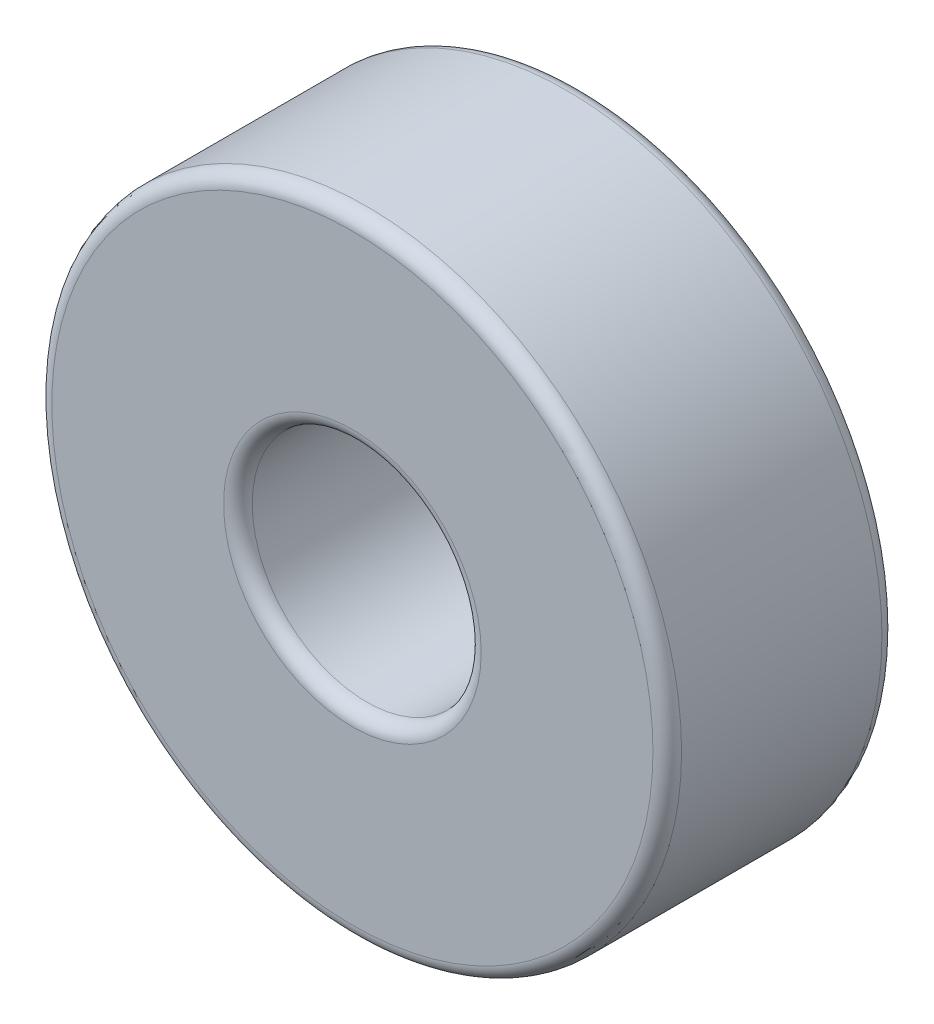
ISO-10303-21;
HEADER;
FILE_DESCRIPTION(('STEP AP214'),'2;1');
FILE_NAME('part.step','',(''),(''),'','','');
FILE_SCHEMA(('AUTOMOTIVE_DESIGN { 1 0 10303 214 1 1 1 1 }'));
ENDSEC;
DATA;
#1=APPLICATION_CONTEXT('core data for automotive mechanical design processes');
#2=APPLICATION_PROTOCOL_DEFINITION('international standard','automotive_design',2000,#1);
#3=PRODUCT_CONTEXT('',#1,'mechanical');
#4=PRODUCT('Part','Part','',(#3));
#5=PRODUCT_RELATED_PRODUCT_CATEGORY('part','',(#4));
#6=PRODUCT_DEFINITION_FORMATION('','',#4);
#7=PRODUCT_DEFINITION_CONTEXT('part definition',#1,'design');
#8=PRODUCT_DEFINITION('design','',#6,#7);
#9=PRODUCT_DEFINITION_SHAPE('','',#8);
#10=(LENGTH_UNIT() NAMED_UNIT(*) SI_UNIT(.MILLI.,.METRE.));
#11=(NAMED_UNIT(*) PLANE_ANGLE_UNIT() SI_UNIT($,.RADIAN.));
#12=(NAMED_UNIT(*) SI_UNIT($,.STERADIAN.) SOLID_ANGLE_UNIT());
#13=UNCERTAINTY_MEASURE_WITH_UNIT(LENGTH_MEASURE(1.E-05),#10,'distance_accuracy_value','');
#14=(GEOMETRIC_REPRESENTATION_CONTEXT(3) GLOBAL_UNCERTAINTY_ASSIGNED_CONTEXT((#13)) GLOBAL_UNIT_ASSIGNED_CONTEXT((#10,
#11,#12)) REPRESENTATION_CONTEXT('',''));
#15=CARTESIAN_POINT('',(0.,0.,0.));
#16=DIRECTION('',(0.,0.,1.));
#17=DIRECTION('',(1.,0.,0.));
#18=AXIS2_PLACEMENT_3D('',#15,#16,#17);
#19=CARTESIAN_POINT('',(0.,0.,8.));
#20=DIRECTION('',(0.,0.,1.));
#21=DIRECTION('',(1.,0.,0.));
#22=AXIS2_PLACEMENT_3D('',#19,#20,#21);
#23=PLANE('',#22);
#24=CARTESIAN_POINT('',(0.,0.,8.));
#25=DIRECTION('',(0.,0.,1.));
#26=DIRECTION('',(1.,0.,0.));
#27=AXIS2_PLACEMENT_3D('',#24,#25,#26);
#28=CIRCLE('',#27,4.5);
#29=CARTESIAN_POINT('',(4.5,0.,8.));
#30=VERTEX_POINT('',#29);
#31=EDGE_CURVE('E39',#30,#30,#28,.F.);
#32=ORIENTED_EDGE('',*,*,#31,.T.);
#33=EDGE_LOOP('',(#32));
#34=FACE_BOUND('',#33,.T.);
#35=CARTESIAN_POINT('',(0.,0.,8.));
#36=DIRECTION('',(0.,0.,1.));
#37=DIRECTION('',(1.,0.,0.));
#38=AXIS2_PLACEMENT_3D('',#35,#36,#37);
#39=CIRCLE('',#38,10.5);
#40=CARTESIAN_POINT('',(10.5,0.,8.));
#41=VERTEX_POINT('',#40);
#42=EDGE_CURVE('E43',#41,#41,#39,.T.);
#43=ORIENTED_EDGE('',*,*,#42,.T.);
#44=EDGE_LOOP('',(#43));
#45=FACE_BOUND('',#44,.T.);
#46=ADVANCED_FACE('F28',(#34,#45),#23,.T.);
#47=CARTESIAN_POINT('',(0.,0.,0.));
#48=DIRECTION('',(0.,0.,1.));
#49=DIRECTION('',(1.,0.,0.));
#50=AXIS2_PLACEMENT_3D('',#47,#48,#49);
#51=PLANE('',#50);
#52=CARTESIAN_POINT('',(0.,0.,0.));
#53=DIRECTION('',(0.,0.,1.));
#54=DIRECTION('',(1.,0.,0.));
#55=AXIS2_PLACEMENT_3D('',#52,#53,#54);
#56=CIRCLE('',#55,4.5);
#57=CARTESIAN_POINT('',(4.5,0.,0.));
#58=VERTEX_POINT('',#57);
#59=EDGE_CURVE('E54',#58,#58,#56,.T.);
#60=ORIENTED_EDGE('',*,*,#59,.T.);
#61=EDGE_LOOP('',(#60));
#62=FACE_BOUND('',#61,.T.);
#63=CARTESIAN_POINT('',(0.,0.,0.));
#64=DIRECTION('',(0.,0.,1.));
#65=DIRECTION('',(1.,0.,0.));
#66=AXIS2_PLACEMENT_3D('',#63,#64,#65);
#67=CIRCLE('',#66,10.5);
#68=CARTESIAN_POINT('',(10.5,0.,0.));
#69=VERTEX_POINT('',#68);
#70=EDGE_CURVE('E57',#69,#69,#67,.F.);
#71=ORIENTED_EDGE('',*,*,#70,.T.);
#72=EDGE_LOOP('',(#71));
#73=FACE_BOUND('',#72,.T.);
#74=ADVANCED_FACE('F61',(#62,#73),#51,.F.);
#75=CARTESIAN_POINT('',(0.,0.,8.));
#76=DIRECTION('',(0.,0.,-1.));
#77=DIRECTION('',(-1.,0.,0.));
#78=AXIS2_PLACEMENT_3D('',#75,#76,#77);
#79=CYLINDRICAL_SURFACE('',#78,11.);
#80=CARTESIAN_POINT('',(0.,0.,0.5));
#81=DIRECTION('',(0.,0.,1.));
#82=DIRECTION('',(1.,0.,0.));
#83=AXIS2_PLACEMENT_3D('',#80,#81,#82);
#84=CIRCLE('',#83,11.);
#85=CARTESIAN_POINT('',(11.,0.,0.5));
#86=VERTEX_POINT('',#85);
#87=EDGE_CURVE('E10',#86,#86,#84,.T.);
#88=ORIENTED_EDGE('',*,*,#87,.T.);
#89=EDGE_LOOP('',(#88));
#90=FACE_BOUND('',#89,.T.);
#91=CARTESIAN_POINT('',(0.,0.,7.5));
#92=DIRECTION('',(0.,0.,1.));
#93=DIRECTION('',(1.,0.,0.));
#94=AXIS2_PLACEMENT_3D('',#91,#92,#93);
#95=CIRCLE('',#94,11.);
#96=CARTESIAN_POINT('',(11.,0.,7.5));
#97=VERTEX_POINT('',#96);
#98=EDGE_CURVE('E35',#97,#97,#95,.F.);
#99=ORIENTED_EDGE('',*,*,#98,.T.);
#100=EDGE_LOOP('',(#99));
#101=FACE_BOUND('',#100,.T.);
#102=ADVANCED_FACE('F81',(#90,#101),#79,.T.);
#103=CARTESIAN_POINT('',(0.,0.,8.));
#104=DIRECTION('',(0.,0.,-1.));
#105=DIRECTION('',(-1.,0.,0.));
#106=AXIS2_PLACEMENT_3D('',#103,#104,#105);
#107=CYLINDRICAL_SURFACE('',#106,4.);
#108=CARTESIAN_POINT('',(0.,0.,0.5));
#109=DIRECTION('',(0.,0.,1.));
#110=DIRECTION('',(1.,0.,0.));
#111=AXIS2_PLACEMENT_3D('',#108,#109,#110);
#112=CIRCLE('',#111,4.);
#113=CARTESIAN_POINT('',(4.,0.,0.5));
#114=VERTEX_POINT('',#113);
#115=EDGE_CURVE('E48',#114,#114,#112,.F.);
#116=ORIENTED_EDGE('',*,*,#115,.T.);
#117=EDGE_LOOP('',(#116));
#118=FACE_BOUND('',#117,.T.);
#119=CARTESIAN_POINT('',(0.,0.,7.5));
#120=DIRECTION('',(0.,0.,1.));
#121=DIRECTION('',(1.,0.,0.));
#122=AXIS2_PLACEMENT_3D('',#119,#120,#121);
#123=CIRCLE('',#122,4.);
#124=CARTESIAN_POINT('',(4.,0.,7.5));
#125=VERTEX_POINT('',#124);
#126=EDGE_CURVE('E51',#125,#125,#123,.T.);
#127=ORIENTED_EDGE('',*,*,#126,.T.);
#128=EDGE_LOOP('',(#127));
#129=FACE_BOUND('',#128,.T.);
#130=ADVANCED_FACE('F86',(#118,#129),#107,.F.);
#131=CARTESIAN_POINT('',(0.,0.,0.5));
#132=DIRECTION('',(0.,0.,1.));
#133=DIRECTION('',(1.,0.,0.));
#134=AXIS2_PLACEMENT_3D('',#131,#132,#133);
#135=TOROIDAL_SURFACE('',#134,4.5,0.5);
#136=ORIENTED_EDGE('',*,*,#115,.F.);
#137=EDGE_LOOP('',(#136));
#138=FACE_BOUND('',#137,.T.);
#139=ORIENTED_EDGE('',*,*,#59,.F.);
#140=EDGE_LOOP('',(#139));
#141=FACE_BOUND('',#140,.T.);
#142=ADVANCED_FACE('F72',(#138,#141),#135,.T.);
#143=CARTESIAN_POINT('',(0.,0.,7.5));
#144=DIRECTION('',(0.,0.,1.));
#145=DIRECTION('',(1.,0.,0.));
#146=AXIS2_PLACEMENT_3D('',#143,#144,#145);
#147=TOROIDAL_SURFACE('',#146,4.5,0.5);
#148=ORIENTED_EDGE('',*,*,#31,.F.);
#149=EDGE_LOOP('',(#148));
#150=FACE_BOUND('',#149,.T.);
#151=ORIENTED_EDGE('',*,*,#126,.F.);
#152=EDGE_LOOP('',(#151));
#153=FACE_BOUND('',#152,.T.);
#154=ADVANCED_FACE('F66',(#150,#153),#147,.T.);
#155=CARTESIAN_POINT('',(0.,0.,0.5));
#156=DIRECTION('',(0.,0.,1.));
#157=DIRECTION('',(1.,0.,0.));
#158=AXIS2_PLACEMENT_3D('',#155,#156,#157);
#159=TOROIDAL_SURFACE('',#158,10.5,0.5);
#160=ORIENTED_EDGE('',*,*,#70,.F.);
#161=EDGE_LOOP('',(#160));
#162=FACE_BOUND('',#161,.T.);
#163=ORIENTED_EDGE('',*,*,#87,.F.);
#164=EDGE_LOOP('',(#163));
#165=FACE_BOUND('',#164,.T.);
#166=ADVANCED_FACE('F63',(#162,#165),#159,.T.);
#167=CARTESIAN_POINT('',(0.,0.,7.5));
#168=DIRECTION('',(0.,0.,1.));
#169=DIRECTION('',(1.,0.,0.));
#170=AXIS2_PLACEMENT_3D('',#167,#168,#169);
#171=TOROIDAL_SURFACE('',#170,10.5,0.5);
#172=ORIENTED_EDGE('',*,*,#98,.F.);
#173=EDGE_LOOP('',(#172));
#174=FACE_BOUND('',#173,.T.);
#175=ORIENTED_EDGE('',*,*,#42,.F.);
#176=EDGE_LOOP('',(#175));
#177=FACE_BOUND('',#176,.T.);
#178=ADVANCED_FACE('F30',(#174,#177),#171,.T.);
#179=CLOSED_SHELL('',(#46,#74,#102,#130,#142,#154,#166,#178));
#180=MANIFOLD_SOLID_BREP('B2',#179);
#181=ADVANCED_BREP_SHAPE_REPRESENTATION('',(#18,#180),#14);
#182=SHAPE_DEFINITION_REPRESENTATION(#9,#181);
ENDSEC;
END-ISO-10303-21;
